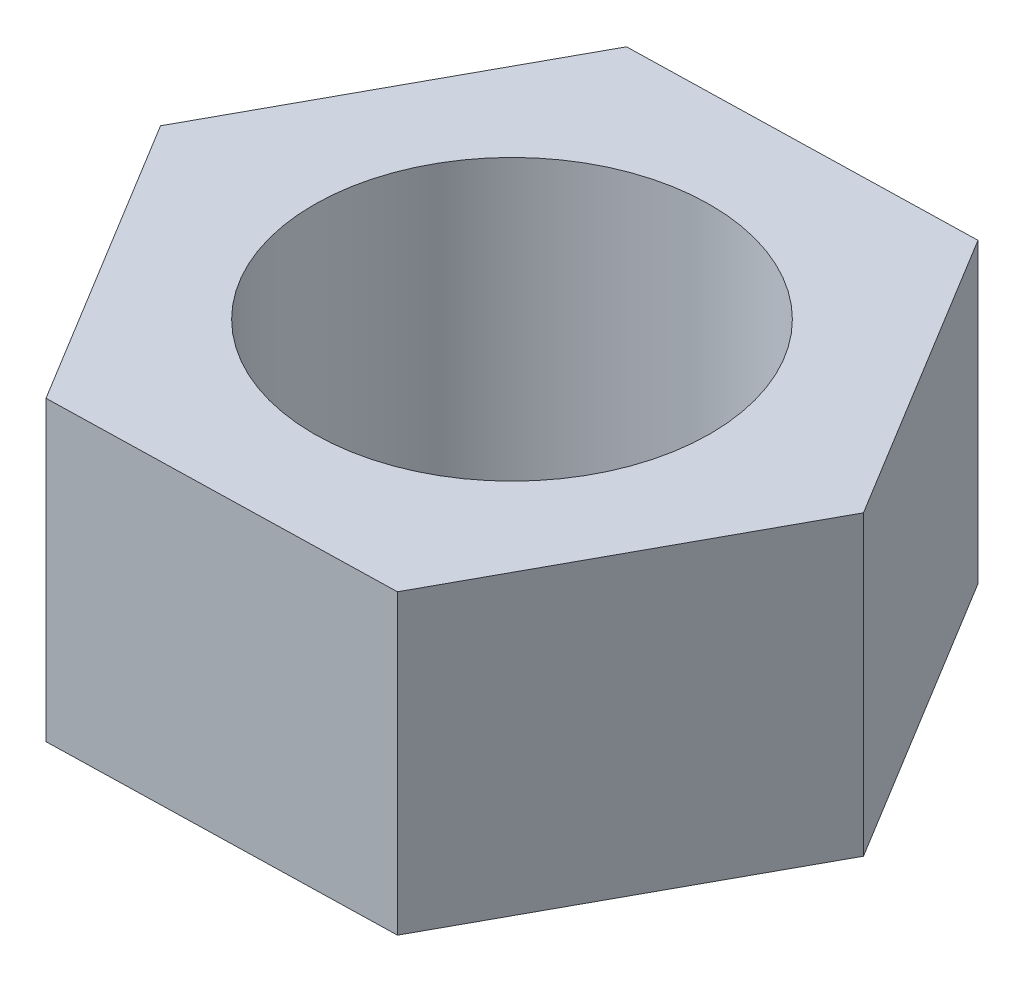
ISO-10303-21;
HEADER;
FILE_DESCRIPTION(('STEP AP214'),'2;1');
FILE_NAME('part.step','',(''),(''),'','','');
FILE_SCHEMA(('AUTOMOTIVE_DESIGN { 1 0 10303 214 1 1 1 1 }'));
ENDSEC;
DATA;
#1=APPLICATION_CONTEXT('core data for automotive mechanical design processes');
#2=APPLICATION_PROTOCOL_DEFINITION('international standard','automotive_design',2000,#1);
#3=PRODUCT_CONTEXT('',#1,'mechanical');
#4=PRODUCT('Part','Part','',(#3));
#5=PRODUCT_RELATED_PRODUCT_CATEGORY('part','',(#4));
#6=PRODUCT_DEFINITION_FORMATION('','',#4);
#7=PRODUCT_DEFINITION_CONTEXT('part definition',#1,'design');
#8=PRODUCT_DEFINITION('design','',#6,#7);
#9=PRODUCT_DEFINITION_SHAPE('','',#8);
#10=(LENGTH_UNIT() NAMED_UNIT(*) SI_UNIT(.MILLI.,.METRE.));
#11=(NAMED_UNIT(*) PLANE_ANGLE_UNIT() SI_UNIT($,.RADIAN.));
#12=(NAMED_UNIT(*) SI_UNIT($,.STERADIAN.) SOLID_ANGLE_UNIT());
#13=UNCERTAINTY_MEASURE_WITH_UNIT(LENGTH_MEASURE(1.E-05),#10,'distance_accuracy_value','');
#14=(GEOMETRIC_REPRESENTATION_CONTEXT(3) GLOBAL_UNCERTAINTY_ASSIGNED_CONTEXT((#13)) GLOBAL_UNIT_ASSIGNED_CONTEXT((#10,
#11,#12)) REPRESENTATION_CONTEXT('',''));
#15=CARTESIAN_POINT('',(0.,0.,0.));
#16=DIRECTION('',(0.,0.,1.));
#17=DIRECTION('',(1.,0.,0.));
#18=AXIS2_PLACEMENT_3D('',#15,#16,#17);
#19=CARTESIAN_POINT('',(0.,12.,0.));
#20=DIRECTION('',(0.,1.,0.));
#21=DIRECTION('',(0.,0.,1.));
#22=AXIS2_PLACEMENT_3D('',#19,#20,#21);
#23=PLANE('',#22);
#24=DIRECTION('',(-0.479310618088113,0.,0.877645333484997));
#25=VECTOR('',#24,1.);
#26=CARTESIAN_POINT('',(-7.21098262927655,12.,-11.8322326515443));
#27=LINE('',#26,#25);
#28=CARTESIAN_POINT('',(-7.21098262927655,12.,-11.8322326515443));
#29=VERTEX_POINT('',#28);
#30=CARTESIAN_POINT('',(-13.8525053743634,12.,0.328777817429632));
#31=VERTEX_POINT('',#30);
#32=EDGE_CURVE('E133',#29,#31,#27,.T.);
#33=ORIENTED_EDGE('',*,*,#32,.T.);
#34=DIRECTION('',(0.520407845266816,0.,0.853917838310425));
#35=VECTOR('',#34,1.);
#36=CARTESIAN_POINT('',(-13.8525053743634,12.,0.328777817429632));
#37=LINE('',#36,#35);
#38=CARTESIAN_POINT('',(-6.64152274508683,12.,12.161010468974));
#39=VERTEX_POINT('',#38);
#40=EDGE_CURVE('E91',#31,#39,#37,.T.);
#41=ORIENTED_EDGE('',*,*,#40,.T.);
#42=DIRECTION('',(0.999718463354929,0.,-0.0237274951745716));
#43=VECTOR('',#42,1.);
#44=CARTESIAN_POINT('',(-6.64152274508683,12.,12.161010468974));
#45=LINE('',#44,#43);
#46=CARTESIAN_POINT('',(7.21098262927655,12.,11.8322326515443));
#47=VERTEX_POINT('',#46);
#48=EDGE_CURVE('E104',#39,#47,#45,.T.);
#49=ORIENTED_EDGE('',*,*,#48,.T.);
#50=DIRECTION('',(0.479310618088113,0.,-0.877645333484997));
#51=VECTOR('',#50,1.);
#52=CARTESIAN_POINT('',(7.21098262927655,12.,11.8322326515443));
#53=LINE('',#52,#51);
#54=CARTESIAN_POINT('',(13.8525053743634,12.,-0.328777817429628));
#55=VERTEX_POINT('',#54);
#56=EDGE_CURVE('E98',#47,#55,#53,.T.);
#57=ORIENTED_EDGE('',*,*,#56,.T.);
#58=DIRECTION('',(-0.520407845266816,0.,-0.853917838310425));
#59=VECTOR('',#58,1.);
#60=CARTESIAN_POINT('',(13.8525053743634,12.,-0.328777817429628));
#61=LINE('',#60,#59);
#62=CARTESIAN_POINT('',(6.64152274508683,12.,-12.161010468974));
#63=VERTEX_POINT('',#62);
#64=EDGE_CURVE('E102',#55,#63,#61,.T.);
#65=ORIENTED_EDGE('',*,*,#64,.T.);
#66=DIRECTION('',(-0.999718463354929,0.,0.0237274951745714));
#67=VECTOR('',#66,1.);
#68=CARTESIAN_POINT('',(6.64152274508683,12.,-12.161010468974));
#69=LINE('',#68,#67);
#70=EDGE_CURVE('E54',#63,#29,#69,.T.);
#71=ORIENTED_EDGE('',*,*,#70,.T.);
#72=EDGE_LOOP('',(#33,#41,#49,#57,#65,#71));
#73=FACE_BOUND('',#72,.T.);
#74=CARTESIAN_POINT('',(0.,12.,0.));
#75=DIRECTION('',(0.,1.,0.));
#76=DIRECTION('',(0.,0.,1.));
#77=AXIS2_PLACEMENT_3D('',#74,#75,#76);
#78=CIRCLE('',#77,8.);
#79=CARTESIAN_POINT('',(0.,12.,8.));
#80=VERTEX_POINT('',#79);
#81=EDGE_CURVE('E126',#80,#80,#78,.T.);
#82=ORIENTED_EDGE('',*,*,#81,.F.);
#83=EDGE_LOOP('',(#82));
#84=FACE_BOUND('',#83,.T.);
#85=ADVANCED_FACE('F37',(#73,#84),#23,.T.);
#86=CARTESIAN_POINT('',(0.,0.,0.));
#87=DIRECTION('',(0.,1.,0.));
#88=DIRECTION('',(0.,0.,1.));
#89=AXIS2_PLACEMENT_3D('',#86,#87,#88);
#90=PLANE('',#89);
#91=DIRECTION('',(-0.479310618088113,0.,0.877645333484997));
#92=VECTOR('',#91,1.);
#93=CARTESIAN_POINT('',(-7.21098262927655,0.,-11.8322326515443));
#94=LINE('',#93,#92);
#95=CARTESIAN_POINT('',(-7.21098262927655,0.,-11.8322326515443));
#96=VERTEX_POINT('',#95);
#97=CARTESIAN_POINT('',(-13.8525053743634,0.,0.328777817429632));
#98=VERTEX_POINT('',#97);
#99=EDGE_CURVE('E122',#96,#98,#94,.T.);
#100=ORIENTED_EDGE('',*,*,#99,.F.);
#101=DIRECTION('',(-0.999718463354929,0.,0.0237274951745714));
#102=VECTOR('',#101,1.);
#103=CARTESIAN_POINT('',(6.64152274508683,0.,-12.161010468974));
#104=LINE('',#103,#102);
#105=CARTESIAN_POINT('',(6.64152274508683,0.,-12.161010468974));
#106=VERTEX_POINT('',#105);
#107=EDGE_CURVE('E83',#106,#96,#104,.T.);
#108=ORIENTED_EDGE('',*,*,#107,.F.);
#109=DIRECTION('',(-0.520407845266816,0.,-0.853917838310425));
#110=VECTOR('',#109,1.);
#111=CARTESIAN_POINT('',(13.8525053743634,0.,-0.328777817429628));
#112=LINE('',#111,#110);
#113=CARTESIAN_POINT('',(13.8525053743634,0.,-0.328777817429628));
#114=VERTEX_POINT('',#113);
#115=EDGE_CURVE('E77',#114,#106,#112,.T.);
#116=ORIENTED_EDGE('',*,*,#115,.F.);
#117=DIRECTION('',(0.479310618088113,0.,-0.877645333484997));
#118=VECTOR('',#117,1.);
#119=CARTESIAN_POINT('',(7.21098262927655,0.,11.8322326515443));
#120=LINE('',#119,#118);
#121=CARTESIAN_POINT('',(7.21098262927655,0.,11.8322326515443));
#122=VERTEX_POINT('',#121);
#123=EDGE_CURVE('E112',#122,#114,#120,.T.);
#124=ORIENTED_EDGE('',*,*,#123,.F.);
#125=DIRECTION('',(0.999718463354929,0.,-0.0237274951745716));
#126=VECTOR('',#125,1.);
#127=CARTESIAN_POINT('',(-6.64152274508683,0.,12.161010468974));
#128=LINE('',#127,#126);
#129=CARTESIAN_POINT('',(-6.64152274508683,0.,12.161010468974));
#130=VERTEX_POINT('',#129);
#131=EDGE_CURVE('E128',#130,#122,#128,.T.);
#132=ORIENTED_EDGE('',*,*,#131,.F.);
#133=DIRECTION('',(0.520407845266816,0.,0.853917838310425));
#134=VECTOR('',#133,1.);
#135=CARTESIAN_POINT('',(-13.8525053743634,0.,0.328777817429632));
#136=LINE('',#135,#134);
#137=EDGE_CURVE('E125',#98,#130,#136,.T.);
#138=ORIENTED_EDGE('',*,*,#137,.F.);
#139=EDGE_LOOP('',(#100,#108,#116,#124,#132,#138));
#140=FACE_BOUND('',#139,.T.);
#141=CARTESIAN_POINT('',(0.,0.,0.));
#142=DIRECTION('',(0.,1.,0.));
#143=DIRECTION('',(0.,0.,1.));
#144=AXIS2_PLACEMENT_3D('',#141,#142,#143);
#145=CIRCLE('',#144,8.);
#146=CARTESIAN_POINT('',(0.,0.,8.));
#147=VERTEX_POINT('',#146);
#148=EDGE_CURVE('E226',#147,#147,#145,.T.);
#149=ORIENTED_EDGE('',*,*,#148,.T.);
#150=EDGE_LOOP('',(#149));
#151=FACE_BOUND('',#150,.T.);
#152=ADVANCED_FACE('F142',(#140,#151),#90,.F.);
#153=CARTESIAN_POINT('',(-7.21098262927655,12.,-11.8322326515443));
#154=DIRECTION('',(0.877645333484997,0.,0.479310618088113));
#155=DIRECTION('',(0.479310618088113,0.,-0.877645333484997));
#156=AXIS2_PLACEMENT_3D('',#153,#154,#155);
#157=PLANE('',#156);
#158=ORIENTED_EDGE('',*,*,#99,.T.);
#159=DIRECTION('',(0.,-1.,0.));
#160=VECTOR('',#159,1.);
#161=CARTESIAN_POINT('',(-13.8525053743634,12.,0.328777817429632));
#162=LINE('',#161,#160);
#163=EDGE_CURVE('E11',#31,#98,#162,.T.);
#164=ORIENTED_EDGE('',*,*,#163,.F.);
#165=ORIENTED_EDGE('',*,*,#32,.F.);
#166=DIRECTION('',(0.,-1.,0.));
#167=VECTOR('',#166,1.);
#168=CARTESIAN_POINT('',(-7.21098262927655,12.,-11.8322326515443));
#169=LINE('',#168,#167);
#170=EDGE_CURVE('E118',#29,#96,#169,.T.);
#171=ORIENTED_EDGE('',*,*,#170,.T.);
#172=EDGE_LOOP('',(#158,#164,#165,#171));
#173=FACE_BOUND('',#172,.T.);
#174=ADVANCED_FACE('F39',(#173),#157,.F.);
#175=CARTESIAN_POINT('',(-13.8525053743634,12.,0.328777817429632));
#176=DIRECTION('',(0.853917838310425,0.,-0.520407845266816));
#177=DIRECTION('',(-0.520407845266816,0.,-0.853917838310425));
#178=AXIS2_PLACEMENT_3D('',#175,#176,#177);
#179=PLANE('',#178);
#180=ORIENTED_EDGE('',*,*,#137,.T.);
#181=DIRECTION('',(0.,-1.,0.));
#182=VECTOR('',#181,1.);
#183=CARTESIAN_POINT('',(-6.64152274508683,12.,12.161010468974));
#184=LINE('',#183,#182);
#185=EDGE_CURVE('E46',#39,#130,#184,.T.);
#186=ORIENTED_EDGE('',*,*,#185,.F.);
#187=ORIENTED_EDGE('',*,*,#40,.F.);
#188=ORIENTED_EDGE('',*,*,#163,.T.);
#189=EDGE_LOOP('',(#180,#186,#187,#188));
#190=FACE_BOUND('',#189,.T.);
#191=ADVANCED_FACE('F167',(#190),#179,.F.);
#192=CARTESIAN_POINT('',(-6.64152274508683,12.,12.161010468974));
#193=DIRECTION('',(-0.0237274951745716,0.,-0.999718463354929));
#194=DIRECTION('',(-0.999718463354929,0.,0.0237274951745716));
#195=AXIS2_PLACEMENT_3D('',#192,#193,#194);
#196=PLANE('',#195);
#197=ORIENTED_EDGE('',*,*,#131,.T.);
#198=DIRECTION('',(0.,-1.,0.));
#199=VECTOR('',#198,1.);
#200=CARTESIAN_POINT('',(7.21098262927655,12.,11.8322326515443));
#201=LINE('',#200,#199);
#202=EDGE_CURVE('E113',#47,#122,#201,.T.);
#203=ORIENTED_EDGE('',*,*,#202,.F.);
#204=ORIENTED_EDGE('',*,*,#48,.F.);
#205=ORIENTED_EDGE('',*,*,#185,.T.);
#206=EDGE_LOOP('',(#197,#203,#204,#205));
#207=FACE_BOUND('',#206,.T.);
#208=ADVANCED_FACE('F139',(#207),#196,.F.);
#209=CARTESIAN_POINT('',(7.21098262927655,12.,11.8322326515443));
#210=DIRECTION('',(-0.877645333484997,0.,-0.479310618088113));
#211=DIRECTION('',(-0.479310618088113,0.,0.877645333484997));
#212=AXIS2_PLACEMENT_3D('',#209,#210,#211);
#213=PLANE('',#212);
#214=ORIENTED_EDGE('',*,*,#123,.T.);
#215=DIRECTION('',(0.,-1.,0.));
#216=VECTOR('',#215,1.);
#217=CARTESIAN_POINT('',(13.8525053743634,12.,-0.328777817429628));
#218=LINE('',#217,#216);
#219=EDGE_CURVE('E109',#55,#114,#218,.T.);
#220=ORIENTED_EDGE('',*,*,#219,.F.);
#221=ORIENTED_EDGE('',*,*,#56,.F.);
#222=ORIENTED_EDGE('',*,*,#202,.T.);
#223=EDGE_LOOP('',(#214,#220,#221,#222));
#224=FACE_BOUND('',#223,.T.);
#225=ADVANCED_FACE('F110',(#224),#213,.F.);
#226=CARTESIAN_POINT('',(13.8525053743634,12.,-0.328777817429628));
#227=DIRECTION('',(-0.853917838310425,0.,0.520407845266816));
#228=DIRECTION('',(0.520407845266816,0.,0.853917838310425));
#229=AXIS2_PLACEMENT_3D('',#226,#227,#228);
#230=PLANE('',#229);
#231=ORIENTED_EDGE('',*,*,#115,.T.);
#232=DIRECTION('',(0.,-1.,0.));
#233=VECTOR('',#232,1.);
#234=CARTESIAN_POINT('',(6.64152274508683,12.,-12.161010468974));
#235=LINE('',#234,#233);
#236=EDGE_CURVE('E114',#63,#106,#235,.T.);
#237=ORIENTED_EDGE('',*,*,#236,.F.);
#238=ORIENTED_EDGE('',*,*,#64,.F.);
#239=ORIENTED_EDGE('',*,*,#219,.T.);
#240=EDGE_LOOP('',(#231,#237,#238,#239));
#241=FACE_BOUND('',#240,.T.);
#242=ADVANCED_FACE('F116',(#241),#230,.F.);
#243=CARTESIAN_POINT('',(6.64152274508683,12.,-12.161010468974));
#244=DIRECTION('',(0.0237274951745714,0.,0.999718463354929));
#245=DIRECTION('',(0.999718463354929,0.,-0.0237274951745714));
#246=AXIS2_PLACEMENT_3D('',#243,#244,#245);
#247=PLANE('',#246);
#248=ORIENTED_EDGE('',*,*,#107,.T.);
#249=ORIENTED_EDGE('',*,*,#170,.F.);
#250=ORIENTED_EDGE('',*,*,#70,.F.);
#251=ORIENTED_EDGE('',*,*,#236,.T.);
#252=EDGE_LOOP('',(#248,#249,#250,#251));
#253=FACE_BOUND('',#252,.T.);
#254=ADVANCED_FACE('F147',(#253),#247,.F.);
#255=CARTESIAN_POINT('',(0.,12.,0.));
#256=DIRECTION('',(0.,-1.,0.));
#257=DIRECTION('',(0.,0.,-1.));
#258=AXIS2_PLACEMENT_3D('',#255,#256,#257);
#259=CYLINDRICAL_SURFACE('',#258,8.);
#260=ORIENTED_EDGE('',*,*,#81,.T.);
#261=EDGE_LOOP('',(#260));
#262=FACE_BOUND('',#261,.T.);
#263=ORIENTED_EDGE('',*,*,#148,.F.);
#264=EDGE_LOOP('',(#263));
#265=FACE_BOUND('',#264,.T.);
#266=ADVANCED_FACE('F149',(#262,#265),#259,.F.);
#267=CLOSED_SHELL('',(#85,#152,#174,#191,#208,#225,#242,#254,#266));
#268=MANIFOLD_SOLID_BREP('B2',#267);
#269=ADVANCED_BREP_SHAPE_REPRESENTATION('',(#18,#268),#14);
#270=SHAPE_DEFINITION_REPRESENTATION(#9,#269);
ENDSEC;
END-ISO-10303-21;
